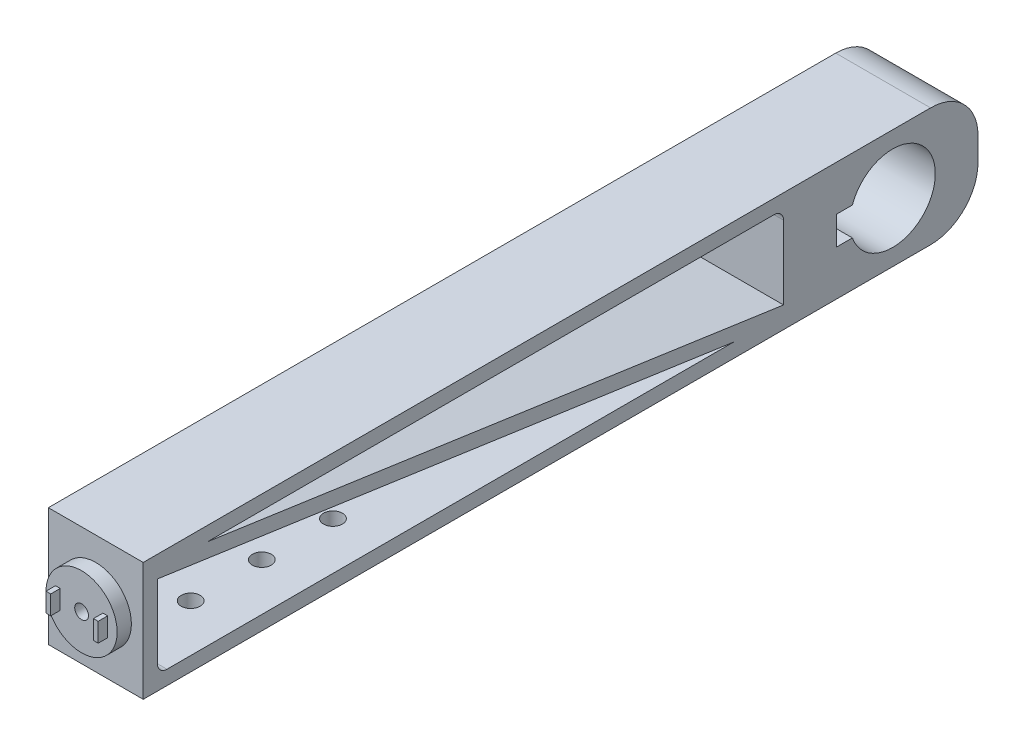
ISO-10303-21;
HEADER;
FILE_DESCRIPTION(('STEP AP214'),'2;1');
FILE_NAME('part.step','',(''),(''),'','','');
FILE_SCHEMA(('AUTOMOTIVE_DESIGN { 1 0 10303 214 1 1 1 1 }'));
ENDSEC;
DATA;
#1=APPLICATION_CONTEXT('core data for automotive mechanical design processes');
#2=APPLICATION_PROTOCOL_DEFINITION('international standard','automotive_design',2000,#1);
#3=PRODUCT_CONTEXT('',#1,'mechanical');
#4=PRODUCT('Part','Part','',(#3));
#5=PRODUCT_RELATED_PRODUCT_CATEGORY('part','',(#4));
#6=PRODUCT_DEFINITION_FORMATION('','',#4);
#7=PRODUCT_DEFINITION_CONTEXT('part definition',#1,'design');
#8=PRODUCT_DEFINITION('design','',#6,#7);
#9=PRODUCT_DEFINITION_SHAPE('','',#8);
#10=(LENGTH_UNIT() NAMED_UNIT(*) SI_UNIT(.MILLI.,.METRE.));
#11=(NAMED_UNIT(*) PLANE_ANGLE_UNIT() SI_UNIT($,.RADIAN.));
#12=(NAMED_UNIT(*) SI_UNIT($,.STERADIAN.) SOLID_ANGLE_UNIT());
#13=UNCERTAINTY_MEASURE_WITH_UNIT(LENGTH_MEASURE(1.E-05),#10,'distance_accuracy_value','');
#14=(GEOMETRIC_REPRESENTATION_CONTEXT(3) GLOBAL_UNCERTAINTY_ASSIGNED_CONTEXT((#13)) GLOBAL_UNIT_ASSIGNED_CONTEXT((#10,
#11,#12)) REPRESENTATION_CONTEXT('',''));
#15=CARTESIAN_POINT('',(0.,0.,0.));
#16=DIRECTION('',(0.,0.,1.));
#17=DIRECTION('',(1.,0.,0.));
#18=AXIS2_PLACEMENT_3D('',#15,#16,#17);
#19=CARTESIAN_POINT('',(10.,0.,91.));
#20=DIRECTION('',(0.,0.,1.));
#21=DIRECTION('',(1.,0.,0.));
#22=AXIS2_PLACEMENT_3D('',#19,#20,#21);
#23=PLANE('',#22);
#24=CARTESIAN_POINT('',(10.,0.,91.));
#25=DIRECTION('',(0.,0.,1.));
#26=DIRECTION('',(1.,0.,0.));
#27=AXIS2_PLACEMENT_3D('',#24,#25,#26);
#28=CIRCLE('',#27,1.45);
#29=CARTESIAN_POINT('',(11.45,0.,91.));
#30=VERTEX_POINT('',#29);
#31=EDGE_CURVE('E551',#30,#30,#28,.T.);
#32=ORIENTED_EDGE('',*,*,#31,.F.);
#33=EDGE_LOOP('',(#32));
#34=FACE_BOUND('',#33,.T.);
#35=CARTESIAN_POINT('',(10.,0.,91.));
#36=DIRECTION('',(0.,0.,1.));
#37=DIRECTION('',(1.,0.,0.));
#38=AXIS2_PLACEMENT_3D('',#35,#36,#37);
#39=CIRCLE('',#38,7.5);
#40=CARTESIAN_POINT('',(17.5,0.,91.));
#41=VERTEX_POINT('',#40);
#42=EDGE_CURVE('E287',#41,#41,#39,.T.);
#43=ORIENTED_EDGE('',*,*,#42,.T.);
#44=EDGE_LOOP('',(#43));
#45=FACE_BOUND('',#44,.T.);
#46=DIRECTION('',(1.,0.,0.));
#47=VECTOR('',#46,1.);
#48=CARTESIAN_POINT('',(15.5,-2.,91.));
#49=LINE('',#48,#47);
#50=CARTESIAN_POINT('',(14.5,-2.,91.));
#51=VERTEX_POINT('',#50);
#52=CARTESIAN_POINT('',(15.5,-2.,91.));
#53=VERTEX_POINT('',#52);
#54=EDGE_CURVE('E256',#51,#53,#49,.T.);
#55=ORIENTED_EDGE('',*,*,#54,.F.);
#56=DIRECTION('',(0.,-1.,0.));
#57=VECTOR('',#56,1.);
#58=CARTESIAN_POINT('',(14.5,-2.,91.));
#59=LINE('',#58,#57);
#60=CARTESIAN_POINT('',(14.5,2.,91.));
#61=VERTEX_POINT('',#60);
#62=EDGE_CURVE('E253',#61,#51,#59,.T.);
#63=ORIENTED_EDGE('',*,*,#62,.F.);
#64=DIRECTION('',(-1.,0.,0.));
#65=VECTOR('',#64,1.);
#66=CARTESIAN_POINT('',(15.5,2.,91.));
#67=LINE('',#66,#65);
#68=CARTESIAN_POINT('',(15.5,2.,91.));
#69=VERTEX_POINT('',#68);
#70=EDGE_CURVE('E266',#69,#61,#67,.T.);
#71=ORIENTED_EDGE('',*,*,#70,.F.);
#72=DIRECTION('',(0.,1.,0.));
#73=VECTOR('',#72,1.);
#74=CARTESIAN_POINT('',(15.5,-2.,91.));
#75=LINE('',#74,#73);
#76=EDGE_CURVE('E274',#53,#69,#75,.T.);
#77=ORIENTED_EDGE('',*,*,#76,.F.);
#78=EDGE_LOOP('',(#55,#63,#71,#77));
#79=FACE_BOUND('',#78,.T.);
#80=DIRECTION('',(1.,0.,0.));
#81=VECTOR('',#80,1.);
#82=CARTESIAN_POINT('',(4.5,-2.,91.));
#83=LINE('',#82,#81);
#84=CARTESIAN_POINT('',(4.5,-2.,91.));
#85=VERTEX_POINT('',#84);
#86=CARTESIAN_POINT('',(5.5,-2.,91.));
#87=VERTEX_POINT('',#86);
#88=EDGE_CURVE('E560',#85,#87,#83,.T.);
#89=ORIENTED_EDGE('',*,*,#88,.F.);
#90=DIRECTION('',(0.,-1.,0.));
#91=VECTOR('',#90,1.);
#92=CARTESIAN_POINT('',(4.5,-2.,91.));
#93=LINE('',#92,#91);
#94=CARTESIAN_POINT('',(4.5,2.,91.));
#95=VERTEX_POINT('',#94);
#96=EDGE_CURVE('E251',#95,#85,#93,.T.);
#97=ORIENTED_EDGE('',*,*,#96,.F.);
#98=DIRECTION('',(-1.,0.,0.));
#99=VECTOR('',#98,1.);
#100=CARTESIAN_POINT('',(4.5,2.,91.));
#101=LINE('',#100,#99);
#102=CARTESIAN_POINT('',(5.5,2.,91.));
#103=VERTEX_POINT('',#102);
#104=EDGE_CURVE('E247',#103,#95,#101,.T.);
#105=ORIENTED_EDGE('',*,*,#104,.F.);
#106=DIRECTION('',(0.,1.,0.));
#107=VECTOR('',#106,1.);
#108=CARTESIAN_POINT('',(5.5,-2.,91.));
#109=LINE('',#108,#107);
#110=EDGE_CURVE('E562',#87,#103,#109,.T.);
#111=ORIENTED_EDGE('',*,*,#110,.F.);
#112=EDGE_LOOP('',(#89,#97,#105,#111));
#113=FACE_BOUND('',#112,.T.);
#114=ADVANCED_FACE('F55',(#34,#45,#79,#113),#23,.T.);
#115=CARTESIAN_POINT('',(20.,0.,-88.));
#116=DIRECTION('',(0.,0.,-1.));
#117=DIRECTION('',(-1.,0.,0.));
#118=AXIS2_PLACEMENT_3D('',#115,#116,#117);
#119=PLANE('',#118);
#120=DIRECTION('',(0.,-1.,0.));
#121=VECTOR('',#120,1.);
#122=CARTESIAN_POINT('',(0.,0.,-88.));
#123=LINE('',#122,#121);
#124=CARTESIAN_POINT('',(0.,2.5,-88.));
#125=VERTEX_POINT('',#124);
#126=CARTESIAN_POINT('',(0.,-2.5,-88.));
#127=VERTEX_POINT('',#126);
#128=EDGE_CURVE('E366',#125,#127,#123,.T.);
#129=ORIENTED_EDGE('',*,*,#128,.F.);
#130=DIRECTION('',(-1.,0.,0.));
#131=VECTOR('',#130,1.);
#132=CARTESIAN_POINT('',(20.,2.5,-88.));
#133=LINE('',#132,#131);
#134=CARTESIAN_POINT('',(20.,2.5,-88.));
#135=VERTEX_POINT('',#134);
#136=EDGE_CURVE('E295',#135,#125,#133,.T.);
#137=ORIENTED_EDGE('',*,*,#136,.F.);
#138=DIRECTION('',(0.,-1.,0.));
#139=VECTOR('',#138,1.);
#140=CARTESIAN_POINT('',(20.,0.,-88.));
#141=LINE('',#140,#139);
#142=CARTESIAN_POINT('',(20.,-2.5,-88.));
#143=VERTEX_POINT('',#142);
#144=EDGE_CURVE('E323',#135,#143,#141,.T.);
#145=ORIENTED_EDGE('',*,*,#144,.T.);
#146=DIRECTION('',(-1.,0.,0.));
#147=VECTOR('',#146,1.);
#148=CARTESIAN_POINT('',(20.,-2.5,-88.));
#149=LINE('',#148,#147);
#150=EDGE_CURVE('E383',#143,#127,#149,.T.);
#151=ORIENTED_EDGE('',*,*,#150,.T.);
#152=EDGE_LOOP('',(#129,#137,#145,#151));
#153=FACE_BOUND('',#152,.T.);
#154=ADVANCED_FACE('F461',(#153),#119,.T.);
#155=CARTESIAN_POINT('',(20.,2.5,-78.));
#156=DIRECTION('',(-1.,0.,0.));
#157=DIRECTION('',(0.,0.,1.));
#158=AXIS2_PLACEMENT_3D('',#155,#156,#157);
#159=CYLINDRICAL_SURFACE('',#158,10.);
#160=CARTESIAN_POINT('',(0.,2.5,-78.));
#161=DIRECTION('',(1.,0.,0.));
#162=DIRECTION('',(0.,0.,-1.));
#163=AXIS2_PLACEMENT_3D('',#160,#161,#162);
#164=CIRCLE('',#163,10.);
#165=CARTESIAN_POINT('',(0.,12.5,-78.));
#166=VERTEX_POINT('',#165);
#167=EDGE_CURVE('E369',#125,#166,#164,.T.);
#168=ORIENTED_EDGE('',*,*,#167,.T.);
#169=DIRECTION('',(-1.,0.,0.));
#170=VECTOR('',#169,1.);
#171=CARTESIAN_POINT('',(20.,12.5,-78.));
#172=LINE('',#171,#170);
#173=CARTESIAN_POINT('',(20.,12.5,-78.));
#174=VERTEX_POINT('',#173);
#175=EDGE_CURVE('E394',#174,#166,#172,.T.);
#176=ORIENTED_EDGE('',*,*,#175,.F.);
#177=CARTESIAN_POINT('',(20.,2.5,-78.));
#178=DIRECTION('',(1.,0.,0.));
#179=DIRECTION('',(0.,0.,-1.));
#180=AXIS2_PLACEMENT_3D('',#177,#178,#179);
#181=CIRCLE('',#180,10.);
#182=EDGE_CURVE('E326',#135,#174,#181,.T.);
#183=ORIENTED_EDGE('',*,*,#182,.F.);
#184=ORIENTED_EDGE('',*,*,#136,.T.);
#185=EDGE_LOOP('',(#168,#176,#183,#184));
#186=FACE_BOUND('',#185,.T.);
#187=ADVANCED_FACE('F466',(#186),#159,.T.);
#188=CARTESIAN_POINT('',(20.,12.5,0.));
#189=DIRECTION('',(0.,1.,0.));
#190=DIRECTION('',(0.,0.,1.));
#191=AXIS2_PLACEMENT_3D('',#188,#189,#190);
#192=PLANE('',#191);
#193=DIRECTION('',(0.,0.,-1.));
#194=VECTOR('',#193,1.);
#195=CARTESIAN_POINT('',(0.,12.5,0.));
#196=LINE('',#195,#194);
#197=CARTESIAN_POINT('',(0.,12.5,88.));
#198=VERTEX_POINT('',#197);
#199=EDGE_CURVE('E372',#198,#166,#196,.T.);
#200=ORIENTED_EDGE('',*,*,#199,.F.);
#201=DIRECTION('',(-1.,0.,0.));
#202=VECTOR('',#201,1.);
#203=CARTESIAN_POINT('',(20.,12.5,88.));
#204=LINE('',#203,#202);
#205=CARTESIAN_POINT('',(20.,12.5,88.));
#206=VERTEX_POINT('',#205);
#207=EDGE_CURVE('E392',#206,#198,#204,.T.);
#208=ORIENTED_EDGE('',*,*,#207,.F.);
#209=DIRECTION('',(0.,0.,-1.));
#210=VECTOR('',#209,1.);
#211=CARTESIAN_POINT('',(20.,12.5,0.));
#212=LINE('',#211,#210);
#213=EDGE_CURVE('E328',#206,#174,#212,.T.);
#214=ORIENTED_EDGE('',*,*,#213,.T.);
#215=ORIENTED_EDGE('',*,*,#175,.T.);
#216=EDGE_LOOP('',(#200,#208,#214,#215));
#217=FACE_BOUND('',#216,.T.);
#218=ADVANCED_FACE('F495',(#217),#192,.T.);
#219=CARTESIAN_POINT('',(20.,0.,88.));
#220=DIRECTION('',(0.,0.,-1.));
#221=DIRECTION('',(-1.,0.,0.));
#222=AXIS2_PLACEMENT_3D('',#219,#220,#221);
#223=PLANE('',#222);
#224=CARTESIAN_POINT('',(10.,0.,88.));
#225=DIRECTION('',(0.,0.,1.));
#226=DIRECTION('',(1.,0.,0.));
#227=AXIS2_PLACEMENT_3D('',#224,#225,#226);
#228=CIRCLE('',#227,7.5);
#229=CARTESIAN_POINT('',(17.5,0.,88.));
#230=VERTEX_POINT('',#229);
#231=EDGE_CURVE('E291',#230,#230,#228,.T.);
#232=ORIENTED_EDGE('',*,*,#231,.F.);
#233=EDGE_LOOP('',(#232));
#234=FACE_BOUND('',#233,.T.);
#235=DIRECTION('',(0.,-1.,0.));
#236=VECTOR('',#235,1.);
#237=CARTESIAN_POINT('',(0.,0.,88.));
#238=LINE('',#237,#236);
#239=CARTESIAN_POINT('',(0.,-12.5,88.));
#240=VERTEX_POINT('',#239);
#241=EDGE_CURVE('E375',#198,#240,#238,.T.);
#242=ORIENTED_EDGE('',*,*,#241,.T.);
#243=DIRECTION('',(-1.,0.,0.));
#244=VECTOR('',#243,1.);
#245=CARTESIAN_POINT('',(20.,-12.5,88.));
#246=LINE('',#245,#244);
#247=CARTESIAN_POINT('',(20.,-12.5,88.));
#248=VERTEX_POINT('',#247);
#249=EDGE_CURVE('E389',#248,#240,#246,.T.);
#250=ORIENTED_EDGE('',*,*,#249,.F.);
#251=DIRECTION('',(0.,-1.,0.));
#252=VECTOR('',#251,1.);
#253=CARTESIAN_POINT('',(20.,0.,88.));
#254=LINE('',#253,#252);
#255=EDGE_CURVE('E331',#206,#248,#254,.T.);
#256=ORIENTED_EDGE('',*,*,#255,.F.);
#257=ORIENTED_EDGE('',*,*,#207,.T.);
#258=EDGE_LOOP('',(#242,#250,#256,#257));
#259=FACE_BOUND('',#258,.T.);
#260=ADVANCED_FACE('F491',(#234,#259),#223,.F.);
#261=CARTESIAN_POINT('',(20.,-12.5,0.));
#262=DIRECTION('',(0.,1.,0.));
#263=DIRECTION('',(0.,0.,1.));
#264=AXIS2_PLACEMENT_3D('',#261,#262,#263);
#265=PLANE('',#264);
#266=CARTESIAN_POINT('',(9.99999999999999,-12.5,38.));
#267=DIRECTION('',(0.,1.,0.));
#268=DIRECTION('',(0.,0.,1.));
#269=AXIS2_PLACEMENT_3D('',#266,#267,#268);
#270=CIRCLE('',#269,2.);
#271=CARTESIAN_POINT('',(9.99999999999999,-12.5,40.));
#272=VERTEX_POINT('',#271);
#273=EDGE_CURVE('E547',#272,#272,#270,.T.);
#274=ORIENTED_EDGE('',*,*,#273,.T.);
#275=EDGE_LOOP('',(#274));
#276=FACE_BOUND('',#275,.T.);
#277=CARTESIAN_POINT('',(9.99999999999999,-12.5,68.));
#278=DIRECTION('',(0.,1.,0.));
#279=DIRECTION('',(0.,0.,1.));
#280=AXIS2_PLACEMENT_3D('',#277,#278,#279);
#281=CIRCLE('',#280,2.);
#282=CARTESIAN_POINT('',(9.99999999999999,-12.5,70.));
#283=VERTEX_POINT('',#282);
#284=EDGE_CURVE('E540',#283,#283,#281,.T.);
#285=ORIENTED_EDGE('',*,*,#284,.T.);
#286=EDGE_LOOP('',(#285));
#287=FACE_BOUND('',#286,.T.);
#288=CARTESIAN_POINT('',(9.99999999999999,-12.5,53.));
#289=DIRECTION('',(0.,1.,0.));
#290=DIRECTION('',(0.,0.,1.));
#291=AXIS2_PLACEMENT_3D('',#288,#289,#290);
#292=CIRCLE('',#291,2.);
#293=CARTESIAN_POINT('',(9.99999999999999,-12.5,55.));
#294=VERTEX_POINT('',#293);
#295=EDGE_CURVE('E537',#294,#294,#292,.T.);
#296=ORIENTED_EDGE('',*,*,#295,.T.);
#297=EDGE_LOOP('',(#296));
#298=FACE_BOUND('',#297,.T.);
#299=DIRECTION('',(0.,0.,-1.));
#300=VECTOR('',#299,1.);
#301=CARTESIAN_POINT('',(0.,-12.5,0.));
#302=LINE('',#301,#300);
#303=CARTESIAN_POINT('',(0.,-12.5,-78.));
#304=VERTEX_POINT('',#303);
#305=EDGE_CURVE('E378',#240,#304,#302,.T.);
#306=ORIENTED_EDGE('',*,*,#305,.T.);
#307=DIRECTION('',(-1.,0.,0.));
#308=VECTOR('',#307,1.);
#309=CARTESIAN_POINT('',(20.,-12.5,-78.));
#310=LINE('',#309,#308);
#311=CARTESIAN_POINT('',(20.,-12.5,-78.));
#312=VERTEX_POINT('',#311);
#313=EDGE_CURVE('E385',#312,#304,#310,.T.);
#314=ORIENTED_EDGE('',*,*,#313,.F.);
#315=DIRECTION('',(0.,0.,-1.));
#316=VECTOR('',#315,1.);
#317=CARTESIAN_POINT('',(20.,-12.5,0.));
#318=LINE('',#317,#316);
#319=EDGE_CURVE('E334',#248,#312,#318,.T.);
#320=ORIENTED_EDGE('',*,*,#319,.F.);
#321=ORIENTED_EDGE('',*,*,#249,.T.);
#322=EDGE_LOOP('',(#306,#314,#320,#321));
#323=FACE_BOUND('',#322,.T.);
#324=ADVANCED_FACE('F487',(#276,#287,#298,#323),#265,.F.);
#325=CARTESIAN_POINT('',(20.,0.,-70.));
#326=DIRECTION('',(-1.,0.,0.));
#327=DIRECTION('',(0.,0.,1.));
#328=AXIS2_PLACEMENT_3D('',#325,#326,#327);
#329=CYLINDRICAL_SURFACE('',#328,9.);
#330=CARTESIAN_POINT('',(0.,0.,-70.));
#331=DIRECTION('',(1.,0.,0.));
#332=DIRECTION('',(0.,0.,-1.));
#333=AXIS2_PLACEMENT_3D('',#330,#331,#332);
#334=CIRCLE('',#333,9.);
#335=CARTESIAN_POINT('',(0.,-3.,-61.5147186257614));
#336=VERTEX_POINT('',#335);
#337=CARTESIAN_POINT('',(0.,3.,-61.5147186257614));
#338=VERTEX_POINT('',#337);
#339=EDGE_CURVE('E354',#336,#338,#334,.T.);
#340=ORIENTED_EDGE('',*,*,#339,.F.);
#341=DIRECTION('',(-1.,0.,0.));
#342=VECTOR('',#341,1.);
#343=CARTESIAN_POINT('',(20.,-3.,-61.5147186257614));
#344=LINE('',#343,#342);
#345=CARTESIAN_POINT('',(20.,-3.,-61.5147186257614));
#346=VERTEX_POINT('',#345);
#347=EDGE_CURVE('E386',#346,#336,#344,.T.);
#348=ORIENTED_EDGE('',*,*,#347,.F.);
#349=CARTESIAN_POINT('',(20.,0.,-70.));
#350=DIRECTION('',(1.,0.,0.));
#351=DIRECTION('',(0.,0.,-1.));
#352=AXIS2_PLACEMENT_3D('',#349,#350,#351);
#353=CIRCLE('',#352,9.);
#354=CARTESIAN_POINT('',(20.,3.,-61.5147186257614));
#355=VERTEX_POINT('',#354);
#356=EDGE_CURVE('E312',#346,#355,#353,.T.);
#357=ORIENTED_EDGE('',*,*,#356,.T.);
#358=DIRECTION('',(-1.,0.,0.));
#359=VECTOR('',#358,1.);
#360=CARTESIAN_POINT('',(20.,3.,-61.5147186257614));
#361=LINE('',#360,#359);
#362=EDGE_CURVE('E397',#355,#338,#361,.T.);
#363=ORIENTED_EDGE('',*,*,#362,.T.);
#364=EDGE_LOOP('',(#340,#348,#357,#363));
#365=FACE_BOUND('',#364,.T.);
#366=ADVANCED_FACE('F490',(#365),#329,.F.);
#367=CARTESIAN_POINT('',(20.,-3.,0.));
#368=DIRECTION('',(0.,-1.,0.));
#369=DIRECTION('',(0.,0.,-1.));
#370=AXIS2_PLACEMENT_3D('',#367,#368,#369);
#371=PLANE('',#370);
#372=DIRECTION('',(0.,0.,1.));
#373=VECTOR('',#372,1.);
#374=CARTESIAN_POINT('',(0.,-3.,0.));
#375=LINE('',#374,#373);
#376=CARTESIAN_POINT('',(0.,-3.,-58.2));
#377=VERTEX_POINT('',#376);
#378=EDGE_CURVE('E357',#336,#377,#375,.T.);
#379=ORIENTED_EDGE('',*,*,#378,.T.);
#380=DIRECTION('',(-1.,0.,0.));
#381=VECTOR('',#380,1.);
#382=CARTESIAN_POINT('',(20.,-3.,-58.2));
#383=LINE('',#382,#381);
#384=CARTESIAN_POINT('',(20.,-3.,-58.2));
#385=VERTEX_POINT('',#384);
#386=EDGE_CURVE('E402',#385,#377,#383,.T.);
#387=ORIENTED_EDGE('',*,*,#386,.F.);
#388=DIRECTION('',(0.,0.,1.));
#389=VECTOR('',#388,1.);
#390=CARTESIAN_POINT('',(20.,-3.,0.));
#391=LINE('',#390,#389);
#392=EDGE_CURVE('E315',#346,#385,#391,.T.);
#393=ORIENTED_EDGE('',*,*,#392,.F.);
#394=ORIENTED_EDGE('',*,*,#347,.T.);
#395=EDGE_LOOP('',(#379,#387,#393,#394));
#396=FACE_BOUND('',#395,.T.);
#397=ADVANCED_FACE('F507',(#396),#371,.F.);
#398=CARTESIAN_POINT('',(20.,0.,-58.2));
#399=DIRECTION('',(0.,0.,-1.));
#400=DIRECTION('',(-1.,0.,0.));
#401=AXIS2_PLACEMENT_3D('',#398,#399,#400);
#402=PLANE('',#401);
#403=DIRECTION('',(0.,-1.,0.));
#404=VECTOR('',#403,1.);
#405=CARTESIAN_POINT('',(0.,0.,-58.2));
#406=LINE('',#405,#404);
#407=CARTESIAN_POINT('',(0.,3.,-58.2));
#408=VERTEX_POINT('',#407);
#409=EDGE_CURVE('E360',#408,#377,#406,.T.);
#410=ORIENTED_EDGE('',*,*,#409,.F.);
#411=DIRECTION('',(-1.,0.,0.));
#412=VECTOR('',#411,1.);
#413=CARTESIAN_POINT('',(20.,3.,-58.2));
#414=LINE('',#413,#412);
#415=CARTESIAN_POINT('',(20.,3.,-58.2));
#416=VERTEX_POINT('',#415);
#417=EDGE_CURVE('E399',#416,#408,#414,.T.);
#418=ORIENTED_EDGE('',*,*,#417,.F.);
#419=DIRECTION('',(0.,-1.,0.));
#420=VECTOR('',#419,1.);
#421=CARTESIAN_POINT('',(20.,0.,-58.2));
#422=LINE('',#421,#420);
#423=EDGE_CURVE('E317',#416,#385,#422,.T.);
#424=ORIENTED_EDGE('',*,*,#423,.T.);
#425=ORIENTED_EDGE('',*,*,#386,.T.);
#426=EDGE_LOOP('',(#410,#418,#424,#425));
#427=FACE_BOUND('',#426,.T.);
#428=ADVANCED_FACE('F503',(#427),#402,.T.);
#429=CARTESIAN_POINT('',(20.,-1.19463806828892,0.171955479526435));
#430=DIRECTION('',(0.,0.989798967500017,-0.14247106350379));
#431=DIRECTION('',(0.,0.14247106350379,0.989798967500017));
#432=AXIS2_PLACEMENT_3D('',#429,#430,#431);
#433=PLANE('',#432);
#434=DIRECTION('',(0.,-0.14247106350379,-0.989798967500017));
#435=VECTOR('',#434,1.);
#436=CARTESIAN_POINT('',(0.,-1.19463806828892,0.171955479526435));
#437=LINE('',#436,#435);
#438=CARTESIAN_POINT('',(0.,9.5,74.4715462697441));
#439=VERTEX_POINT('',#438);
#440=CARTESIAN_POINT('',(0.,-7.98454075094802,-47.));
#441=VERTEX_POINT('',#440);
#442=EDGE_CURVE('E347',#439,#441,#437,.T.);
#443=ORIENTED_EDGE('',*,*,#442,.F.);
#444=DIRECTION('',(-1.,0.,0.));
#445=VECTOR('',#444,1.);
#446=CARTESIAN_POINT('',(20.,9.5,74.4715462697441));
#447=LINE('',#446,#445);
#448=CARTESIAN_POINT('',(20.,9.5,74.4715462697441));
#449=VERTEX_POINT('',#448);
#450=EDGE_CURVE('E400',#449,#439,#447,.T.);
#451=ORIENTED_EDGE('',*,*,#450,.F.);
#452=DIRECTION('',(0.,-0.14247106350379,-0.989798967500017));
#453=VECTOR('',#452,1.);
#454=CARTESIAN_POINT('',(20.,-1.19463806828892,0.171955479526435));
#455=LINE('',#454,#453);
#456=CARTESIAN_POINT('',(20.,-7.98454075094802,-47.));
#457=VERTEX_POINT('',#456);
#458=EDGE_CURVE('E305',#449,#457,#455,.T.);
#459=ORIENTED_EDGE('',*,*,#458,.T.);
#460=DIRECTION('',(-1.,0.,0.));
#461=VECTOR('',#460,1.);
#462=CARTESIAN_POINT('',(20.,-7.98454075094802,-47.));
#463=LINE('',#462,#461);
#464=EDGE_CURVE('E405',#457,#441,#463,.T.);
#465=ORIENTED_EDGE('',*,*,#464,.T.);
#466=EDGE_LOOP('',(#443,#451,#459,#465));
#467=FACE_BOUND('',#466,.T.);
#468=ADVANCED_FACE('F506',(#467),#433,.T.);
#469=CARTESIAN_POINT('',(20.,9.5,0.));
#470=DIRECTION('',(0.,1.,0.));
#471=DIRECTION('',(0.,0.,1.));
#472=AXIS2_PLACEMENT_3D('',#469,#470,#471);
#473=PLANE('',#472);
#474=DIRECTION('',(0.,0.,-1.));
#475=VECTOR('',#474,1.);
#476=CARTESIAN_POINT('',(0.,9.5,0.));
#477=LINE('',#476,#475);
#478=CARTESIAN_POINT('',(0.,9.5,-45.));
#479=VERTEX_POINT('',#478);
#480=EDGE_CURVE('E350',#439,#479,#477,.T.);
#481=ORIENTED_EDGE('',*,*,#480,.T.);
#482=DIRECTION('',(-1.,0.,0.));
#483=VECTOR('',#482,1.);
#484=CARTESIAN_POINT('',(20.,9.5,-45.));
#485=LINE('',#484,#483);
#486=CARTESIAN_POINT('',(20.,9.5,-45.));
#487=VERTEX_POINT('',#486);
#488=EDGE_CURVE('E70',#479,#487,#485,.F.);
#489=ORIENTED_EDGE('',*,*,#488,.T.);
#490=DIRECTION('',(0.,0.,-1.));
#491=VECTOR('',#490,1.);
#492=CARTESIAN_POINT('',(20.,9.5,0.));
#493=LINE('',#492,#491);
#494=EDGE_CURVE('E308',#449,#487,#493,.T.);
#495=ORIENTED_EDGE('',*,*,#494,.F.);
#496=ORIENTED_EDGE('',*,*,#450,.T.);
#497=EDGE_LOOP('',(#481,#489,#495,#496));
#498=FACE_BOUND('',#497,.T.);
#499=ADVANCED_FACE('F456',(#498),#473,.F.);
#500=CARTESIAN_POINT('',(20.,0.,85.));
#501=DIRECTION('',(0.,0.,-1.));
#502=DIRECTION('',(-1.,0.,0.));
#503=AXIS2_PLACEMENT_3D('',#500,#501,#502);
#504=PLANE('',#503);
#505=CARTESIAN_POINT('',(10.,0.,85.));
#506=DIRECTION('',(0.,0.,-1.));
#507=DIRECTION('',(-1.,0.,0.));
#508=AXIS2_PLACEMENT_3D('',#505,#506,#507);
#509=CIRCLE('',#508,1.45);
#510=CARTESIAN_POINT('',(8.55,0.,85.));
#511=VERTEX_POINT('',#510);
#512=EDGE_CURVE('E550',#511,#511,#509,.F.);
#513=ORIENTED_EDGE('',*,*,#512,.T.);
#514=EDGE_LOOP('',(#513));
#515=FACE_BOUND('',#514,.T.);
#516=DIRECTION('',(0.,-1.,0.));
#517=VECTOR('',#516,1.);
#518=CARTESIAN_POINT('',(20.,0.,85.));
#519=LINE('',#518,#517);
#520=CARTESIAN_POINT('',(20.,7.98454075094802,85.));
#521=VERTEX_POINT('',#520);
#522=CARTESIAN_POINT('',(20.,-7.5,85.));
#523=VERTEX_POINT('',#522);
#524=EDGE_CURVE('E296',#521,#523,#519,.T.);
#525=ORIENTED_EDGE('',*,*,#524,.T.);
#526=DIRECTION('',(-1.,0.,0.));
#527=VECTOR('',#526,1.);
#528=CARTESIAN_POINT('',(0.,-7.5,85.));
#529=LINE('',#528,#527);
#530=CARTESIAN_POINT('',(0.,-7.5,85.));
#531=VERTEX_POINT('',#530);
#532=EDGE_CURVE('E294',#523,#531,#529,.T.);
#533=ORIENTED_EDGE('',*,*,#532,.T.);
#534=DIRECTION('',(0.,-1.,0.));
#535=VECTOR('',#534,1.);
#536=CARTESIAN_POINT('',(0.,0.,85.));
#537=LINE('',#536,#535);
#538=CARTESIAN_POINT('',(0.,7.98454075094802,85.));
#539=VERTEX_POINT('',#538);
#540=EDGE_CURVE('E290',#539,#531,#537,.T.);
#541=ORIENTED_EDGE('',*,*,#540,.F.);
#542=DIRECTION('',(-1.,0.,0.));
#543=VECTOR('',#542,1.);
#544=CARTESIAN_POINT('',(20.,7.98454075094802,85.));
#545=LINE('',#544,#543);
#546=EDGE_CURVE('E408',#521,#539,#545,.T.);
#547=ORIENTED_EDGE('',*,*,#546,.F.);
#548=EDGE_LOOP('',(#525,#533,#541,#547));
#549=FACE_BOUND('',#548,.T.);
#550=ADVANCED_FACE('F434',(#515,#549),#504,.T.);
#551=CARTESIAN_POINT('',(20.,-4.16403497078897,0.599368670037806));
#552=DIRECTION('',(0.,0.989798967500017,-0.14247106350379));
#553=DIRECTION('',(0.,0.14247106350379,0.989798967500017));
#554=AXIS2_PLACEMENT_3D('',#551,#552,#553);
#555=PLANE('',#554);
#556=DIRECTION('',(0.,-0.14247106350379,-0.989798967500017));
#557=VECTOR('',#556,1.);
#558=CARTESIAN_POINT('',(0.,-4.16403497078897,0.599368670037806));
#559=LINE('',#558,#557);
#560=CARTESIAN_POINT('',(0.,-9.5,-36.4715462697441));
#561=VERTEX_POINT('',#560);
#562=EDGE_CURVE('E342',#539,#561,#559,.T.);
#563=ORIENTED_EDGE('',*,*,#562,.T.);
#564=DIRECTION('',(-1.,0.,0.));
#565=VECTOR('',#564,1.);
#566=CARTESIAN_POINT('',(20.,-9.5,-36.4715462697441));
#567=LINE('',#566,#565);
#568=CARTESIAN_POINT('',(20.,-9.5,-36.4715462697441));
#569=VERTEX_POINT('',#568);
#570=EDGE_CURVE('E339',#569,#561,#567,.T.);
#571=ORIENTED_EDGE('',*,*,#570,.F.);
#572=DIRECTION('',(0.,-0.14247106350379,-0.989798967500017));
#573=VECTOR('',#572,1.);
#574=CARTESIAN_POINT('',(20.,-4.16403497078897,0.599368670037806));
#575=LINE('',#574,#573);
#576=EDGE_CURVE('E299',#521,#569,#575,.T.);
#577=ORIENTED_EDGE('',*,*,#576,.F.);
#578=ORIENTED_EDGE('',*,*,#546,.T.);
#579=EDGE_LOOP('',(#563,#571,#577,#578));
#580=FACE_BOUND('',#579,.T.);
#581=ADVANCED_FACE('F446',(#580),#555,.F.);
#582=CARTESIAN_POINT('',(20.,3.,0.));
#583=DIRECTION('',(0.,-1.,0.));
#584=DIRECTION('',(0.,0.,-1.));
#585=AXIS2_PLACEMENT_3D('',#582,#583,#584);
#586=PLANE('',#585);
#587=DIRECTION('',(0.,0.,1.));
#588=VECTOR('',#587,1.);
#589=CARTESIAN_POINT('',(0.,3.,0.));
#590=LINE('',#589,#588);
#591=EDGE_CURVE('E363',#338,#408,#590,.T.);
#592=ORIENTED_EDGE('',*,*,#591,.F.);
#593=ORIENTED_EDGE('',*,*,#362,.F.);
#594=DIRECTION('',(0.,0.,1.));
#595=VECTOR('',#594,1.);
#596=CARTESIAN_POINT('',(20.,3.,0.));
#597=LINE('',#596,#595);
#598=EDGE_CURVE('E320',#355,#416,#597,.T.);
#599=ORIENTED_EDGE('',*,*,#598,.T.);
#600=ORIENTED_EDGE('',*,*,#417,.T.);
#601=EDGE_LOOP('',(#592,#593,#599,#600));
#602=FACE_BOUND('',#601,.T.);
#603=ADVANCED_FACE('F448',(#602),#586,.T.);
#604=CARTESIAN_POINT('',(20.,0.,-47.));
#605=DIRECTION('',(0.,0.,-1.));
#606=DIRECTION('',(-1.,0.,0.));
#607=AXIS2_PLACEMENT_3D('',#604,#605,#606);
#608=PLANE('',#607);
#609=DIRECTION('',(0.,-1.,0.));
#610=VECTOR('',#609,1.);
#611=CARTESIAN_POINT('',(20.,0.,-47.));
#612=LINE('',#611,#610);
#613=CARTESIAN_POINT('',(20.,7.5,-47.));
#614=VERTEX_POINT('',#613);
#615=EDGE_CURVE('E310',#614,#457,#612,.T.);
#616=ORIENTED_EDGE('',*,*,#615,.F.);
#617=DIRECTION('',(-1.,0.,0.));
#618=VECTOR('',#617,1.);
#619=CARTESIAN_POINT('',(0.,7.5,-47.));
#620=LINE('',#619,#618);
#621=CARTESIAN_POINT('',(0.,7.5,-47.));
#622=VERTEX_POINT('',#621);
#623=EDGE_CURVE('E417',#614,#622,#620,.T.);
#624=ORIENTED_EDGE('',*,*,#623,.T.);
#625=DIRECTION('',(0.,-1.,0.));
#626=VECTOR('',#625,1.);
#627=CARTESIAN_POINT('',(0.,0.,-47.));
#628=LINE('',#627,#626);
#629=EDGE_CURVE('E352',#622,#441,#628,.T.);
#630=ORIENTED_EDGE('',*,*,#629,.T.);
#631=ORIENTED_EDGE('',*,*,#464,.F.);
#632=EDGE_LOOP('',(#616,#624,#630,#631));
#633=FACE_BOUND('',#632,.T.);
#634=ADVANCED_FACE('F453',(#633),#608,.F.);
#635=CARTESIAN_POINT('',(20.,-9.5,0.));
#636=DIRECTION('',(0.,1.,0.));
#637=DIRECTION('',(0.,0.,1.));
#638=AXIS2_PLACEMENT_3D('',#635,#636,#637);
#639=PLANE('',#638);
#640=CARTESIAN_POINT('',(9.99999999999999,-9.5,38.));
#641=DIRECTION('',(0.,1.,0.));
#642=DIRECTION('',(0.,0.,1.));
#643=AXIS2_PLACEMENT_3D('',#640,#641,#642);
#644=CIRCLE('',#643,2.);
#645=CARTESIAN_POINT('',(9.99999999999999,-9.5,40.));
#646=VERTEX_POINT('',#645);
#647=EDGE_CURVE('E528',#646,#646,#644,.T.);
#648=ORIENTED_EDGE('',*,*,#647,.F.);
#649=EDGE_LOOP('',(#648));
#650=FACE_BOUND('',#649,.T.);
#651=CARTESIAN_POINT('',(9.99999999999999,-9.5,68.));
#652=DIRECTION('',(0.,1.,0.));
#653=DIRECTION('',(0.,0.,1.));
#654=AXIS2_PLACEMENT_3D('',#651,#652,#653);
#655=CIRCLE('',#654,2.);
#656=CARTESIAN_POINT('',(9.99999999999999,-9.5,70.));
#657=VERTEX_POINT('',#656);
#658=EDGE_CURVE('E532',#657,#657,#655,.T.);
#659=ORIENTED_EDGE('',*,*,#658,.F.);
#660=EDGE_LOOP('',(#659));
#661=FACE_BOUND('',#660,.T.);
#662=CARTESIAN_POINT('',(9.99999999999999,-9.5,53.));
#663=DIRECTION('',(0.,1.,0.));
#664=DIRECTION('',(0.,0.,1.));
#665=AXIS2_PLACEMENT_3D('',#662,#663,#664);
#666=CIRCLE('',#665,2.);
#667=CARTESIAN_POINT('',(9.99999999999999,-9.5,55.));
#668=VERTEX_POINT('',#667);
#669=EDGE_CURVE('E535',#668,#668,#666,.T.);
#670=ORIENTED_EDGE('',*,*,#669,.F.);
#671=EDGE_LOOP('',(#670));
#672=FACE_BOUND('',#671,.T.);
#673=DIRECTION('',(0.,0.,-1.));
#674=VECTOR('',#673,1.);
#675=CARTESIAN_POINT('',(0.,-9.5,0.));
#676=LINE('',#675,#674);
#677=CARTESIAN_POINT('',(0.,-9.5,83.));
#678=VERTEX_POINT('',#677);
#679=EDGE_CURVE('E345',#678,#561,#676,.T.);
#680=ORIENTED_EDGE('',*,*,#679,.F.);
#681=DIRECTION('',(-1.,0.,0.));
#682=VECTOR('',#681,1.);
#683=CARTESIAN_POINT('',(20.,-9.5,83.));
#684=LINE('',#683,#682);
#685=CARTESIAN_POINT('',(20.,-9.5,83.));
#686=VERTEX_POINT('',#685);
#687=EDGE_CURVE('E415',#678,#686,#684,.F.);
#688=ORIENTED_EDGE('',*,*,#687,.T.);
#689=DIRECTION('',(0.,0.,-1.));
#690=VECTOR('',#689,1.);
#691=CARTESIAN_POINT('',(20.,-9.5,0.));
#692=LINE('',#691,#690);
#693=EDGE_CURVE('E303',#686,#569,#692,.T.);
#694=ORIENTED_EDGE('',*,*,#693,.T.);
#695=ORIENTED_EDGE('',*,*,#570,.T.);
#696=EDGE_LOOP('',(#680,#688,#694,#695));
#697=FACE_BOUND('',#696,.T.);
#698=ADVANCED_FACE('F443',(#650,#661,#672,#697),#639,.T.);
#699=CARTESIAN_POINT('',(20.,-2.5,-78.));
#700=DIRECTION('',(-1.,0.,0.));
#701=DIRECTION('',(0.,0.,1.));
#702=AXIS2_PLACEMENT_3D('',#699,#700,#701);
#703=CYLINDRICAL_SURFACE('',#702,10.);
#704=CARTESIAN_POINT('',(0.,-2.5,-78.));
#705=DIRECTION('',(1.,0.,0.));
#706=DIRECTION('',(0.,0.,-1.));
#707=AXIS2_PLACEMENT_3D('',#704,#705,#706);
#708=CIRCLE('',#707,10.);
#709=EDGE_CURVE('E300',#304,#127,#708,.T.);
#710=ORIENTED_EDGE('',*,*,#709,.T.);
#711=ORIENTED_EDGE('',*,*,#150,.F.);
#712=CARTESIAN_POINT('',(20.,-2.5,-78.));
#713=DIRECTION('',(1.,0.,0.));
#714=DIRECTION('',(0.,0.,-1.));
#715=AXIS2_PLACEMENT_3D('',#712,#713,#714);
#716=CIRCLE('',#715,10.);
#717=EDGE_CURVE('E337',#312,#143,#716,.T.);
#718=ORIENTED_EDGE('',*,*,#717,.F.);
#719=ORIENTED_EDGE('',*,*,#313,.T.);
#720=EDGE_LOOP('',(#710,#711,#718,#719));
#721=FACE_BOUND('',#720,.T.);
#722=ADVANCED_FACE('F481',(#721),#703,.T.);
#723=CARTESIAN_POINT('',(20.,0.,0.));
#724=DIRECTION('',(1.,0.,0.));
#725=DIRECTION('',(0.,0.,-1.));
#726=AXIS2_PLACEMENT_3D('',#723,#724,#725);
#727=PLANE('',#726);
#728=ORIENTED_EDGE('',*,*,#524,.F.);
#729=ORIENTED_EDGE('',*,*,#576,.T.);
#730=ORIENTED_EDGE('',*,*,#693,.F.);
#731=CARTESIAN_POINT('',(20.,-7.5,83.));
#732=DIRECTION('',(1.,0.,0.));
#733=DIRECTION('',(0.,0.,-1.));
#734=AXIS2_PLACEMENT_3D('',#731,#732,#733);
#735=CIRCLE('',#734,2.);
#736=EDGE_CURVE('E423',#686,#523,#735,.F.);
#737=ORIENTED_EDGE('',*,*,#736,.T.);
#738=EDGE_LOOP('',(#728,#729,#730,#737));
#739=FACE_BOUND('',#738,.T.);
#740=ORIENTED_EDGE('',*,*,#458,.F.);
#741=ORIENTED_EDGE('',*,*,#494,.T.);
#742=CARTESIAN_POINT('',(20.,7.5,-45.));
#743=DIRECTION('',(1.,0.,0.));
#744=DIRECTION('',(0.,0.,-1.));
#745=AXIS2_PLACEMENT_3D('',#742,#743,#744);
#746=CIRCLE('',#745,2.);
#747=EDGE_CURVE('E13',#487,#614,#746,.F.);
#748=ORIENTED_EDGE('',*,*,#747,.T.);
#749=ORIENTED_EDGE('',*,*,#615,.T.);
#750=EDGE_LOOP('',(#740,#741,#748,#749));
#751=FACE_BOUND('',#750,.T.);
#752=ORIENTED_EDGE('',*,*,#356,.F.);
#753=ORIENTED_EDGE('',*,*,#392,.T.);
#754=ORIENTED_EDGE('',*,*,#423,.F.);
#755=ORIENTED_EDGE('',*,*,#598,.F.);
#756=EDGE_LOOP('',(#752,#753,#754,#755));
#757=FACE_BOUND('',#756,.T.);
#758=ORIENTED_EDGE('',*,*,#144,.F.);
#759=ORIENTED_EDGE('',*,*,#182,.T.);
#760=ORIENTED_EDGE('',*,*,#213,.F.);
#761=ORIENTED_EDGE('',*,*,#255,.T.);
#762=ORIENTED_EDGE('',*,*,#319,.T.);
#763=ORIENTED_EDGE('',*,*,#717,.T.);
#764=EDGE_LOOP('',(#758,#759,#760,#761,#762,#763));
#765=FACE_BOUND('',#764,.T.);
#766=ADVANCED_FACE('F428',(#739,#751,#757,#765),#727,.T.);
#767=CARTESIAN_POINT('',(0.,0.,0.));
#768=DIRECTION('',(1.,0.,0.));
#769=DIRECTION('',(0.,0.,-1.));
#770=AXIS2_PLACEMENT_3D('',#767,#768,#769);
#771=PLANE('',#770);
#772=ORIENTED_EDGE('',*,*,#540,.T.);
#773=CARTESIAN_POINT('',(0.,-7.5,83.));
#774=DIRECTION('',(1.,0.,0.));
#775=DIRECTION('',(0.,0.,-1.));
#776=AXIS2_PLACEMENT_3D('',#773,#774,#775);
#777=CIRCLE('',#776,2.);
#778=EDGE_CURVE('E421',#531,#678,#777,.T.);
#779=ORIENTED_EDGE('',*,*,#778,.T.);
#780=ORIENTED_EDGE('',*,*,#679,.T.);
#781=ORIENTED_EDGE('',*,*,#562,.F.);
#782=EDGE_LOOP('',(#772,#779,#780,#781));
#783=FACE_BOUND('',#782,.T.);
#784=ORIENTED_EDGE('',*,*,#442,.T.);
#785=ORIENTED_EDGE('',*,*,#629,.F.);
#786=CARTESIAN_POINT('',(0.,7.5,-45.));
#787=DIRECTION('',(1.,0.,0.));
#788=DIRECTION('',(0.,0.,-1.));
#789=AXIS2_PLACEMENT_3D('',#786,#787,#788);
#790=CIRCLE('',#789,2.);
#791=EDGE_CURVE('E63',#622,#479,#790,.T.);
#792=ORIENTED_EDGE('',*,*,#791,.T.);
#793=ORIENTED_EDGE('',*,*,#480,.F.);
#794=EDGE_LOOP('',(#784,#785,#792,#793));
#795=FACE_BOUND('',#794,.T.);
#796=ORIENTED_EDGE('',*,*,#339,.T.);
#797=ORIENTED_EDGE('',*,*,#591,.T.);
#798=ORIENTED_EDGE('',*,*,#409,.T.);
#799=ORIENTED_EDGE('',*,*,#378,.F.);
#800=EDGE_LOOP('',(#796,#797,#798,#799));
#801=FACE_BOUND('',#800,.T.);
#802=ORIENTED_EDGE('',*,*,#128,.T.);
#803=ORIENTED_EDGE('',*,*,#709,.F.);
#804=ORIENTED_EDGE('',*,*,#305,.F.);
#805=ORIENTED_EDGE('',*,*,#241,.F.);
#806=ORIENTED_EDGE('',*,*,#199,.T.);
#807=ORIENTED_EDGE('',*,*,#167,.F.);
#808=EDGE_LOOP('',(#802,#803,#804,#805,#806,#807));
#809=FACE_BOUND('',#808,.T.);
#810=ADVANCED_FACE('F440',(#783,#795,#801,#809),#771,.F.);
#811=CARTESIAN_POINT('',(10.,0.,91.));
#812=DIRECTION('',(0.,0.,-1.));
#813=DIRECTION('',(-1.,0.,0.));
#814=AXIS2_PLACEMENT_3D('',#811,#812,#813);
#815=CYLINDRICAL_SURFACE('',#814,7.5);
#816=ORIENTED_EDGE('',*,*,#42,.F.);
#817=EDGE_LOOP('',(#816));
#818=FACE_BOUND('',#817,.T.);
#819=ORIENTED_EDGE('',*,*,#231,.T.);
#820=EDGE_LOOP('',(#819));
#821=FACE_BOUND('',#820,.T.);
#822=ADVANCED_FACE('F475',(#818,#821),#815,.T.);
#823=CARTESIAN_POINT('',(14.5,-2.,93.));
#824=DIRECTION('',(1.,0.,0.));
#825=DIRECTION('',(0.,0.,-1.));
#826=AXIS2_PLACEMENT_3D('',#823,#824,#825);
#827=PLANE('',#826);
#828=ORIENTED_EDGE('',*,*,#62,.T.);
#829=DIRECTION('',(0.,0.,-1.));
#830=VECTOR('',#829,1.);
#831=CARTESIAN_POINT('',(14.5,-2.,93.));
#832=LINE('',#831,#830);
#833=CARTESIAN_POINT('',(14.5,-2.,93.));
#834=VERTEX_POINT('',#833);
#835=EDGE_CURVE('E285',#834,#51,#832,.T.);
#836=ORIENTED_EDGE('',*,*,#835,.F.);
#837=DIRECTION('',(0.,-1.,0.));
#838=VECTOR('',#837,1.);
#839=CARTESIAN_POINT('',(14.5,-2.,93.));
#840=LINE('',#839,#838);
#841=CARTESIAN_POINT('',(14.5,2.,93.));
#842=VERTEX_POINT('',#841);
#843=EDGE_CURVE('E262',#842,#834,#840,.T.);
#844=ORIENTED_EDGE('',*,*,#843,.F.);
#845=DIRECTION('',(0.,0.,-1.));
#846=VECTOR('',#845,1.);
#847=CARTESIAN_POINT('',(14.5,2.,93.));
#848=LINE('',#847,#846);
#849=EDGE_CURVE('E271',#842,#61,#848,.T.);
#850=ORIENTED_EDGE('',*,*,#849,.T.);
#851=EDGE_LOOP('',(#828,#836,#844,#850));
#852=FACE_BOUND('',#851,.T.);
#853=ADVANCED_FACE('F473',(#852),#827,.F.);
#854=CARTESIAN_POINT('',(15.5,-2.,93.));
#855=DIRECTION('',(0.,1.,0.));
#856=DIRECTION('',(-1.,0.,0.));
#857=AXIS2_PLACEMENT_3D('',#854,#855,#856);
#858=PLANE('',#857);
#859=ORIENTED_EDGE('',*,*,#54,.T.);
#860=DIRECTION('',(0.,0.,-1.));
#861=VECTOR('',#860,1.);
#862=CARTESIAN_POINT('',(15.5,-2.,93.));
#863=LINE('',#862,#861);
#864=CARTESIAN_POINT('',(15.5,-2.,93.));
#865=VERTEX_POINT('',#864);
#866=EDGE_CURVE('E282',#865,#53,#863,.T.);
#867=ORIENTED_EDGE('',*,*,#866,.F.);
#868=DIRECTION('',(1.,0.,0.));
#869=VECTOR('',#868,1.);
#870=CARTESIAN_POINT('',(15.5,-2.,93.));
#871=LINE('',#870,#869);
#872=EDGE_CURVE('E265',#834,#865,#871,.T.);
#873=ORIENTED_EDGE('',*,*,#872,.F.);
#874=ORIENTED_EDGE('',*,*,#835,.T.);
#875=EDGE_LOOP('',(#859,#867,#873,#874));
#876=FACE_BOUND('',#875,.T.);
#877=ADVANCED_FACE('F595',(#876),#858,.F.);
#878=CARTESIAN_POINT('',(15.5,-2.,93.));
#879=DIRECTION('',(-1.,0.,0.));
#880=DIRECTION('',(0.,0.,1.));
#881=AXIS2_PLACEMENT_3D('',#878,#879,#880);
#882=PLANE('',#881);
#883=ORIENTED_EDGE('',*,*,#76,.T.);
#884=DIRECTION('',(0.,0.,-1.));
#885=VECTOR('',#884,1.);
#886=CARTESIAN_POINT('',(15.5,2.,93.));
#887=LINE('',#886,#885);
#888=CARTESIAN_POINT('',(15.5,2.,93.));
#889=VERTEX_POINT('',#888);
#890=EDGE_CURVE('E280',#889,#69,#887,.T.);
#891=ORIENTED_EDGE('',*,*,#890,.F.);
#892=DIRECTION('',(0.,1.,0.));
#893=VECTOR('',#892,1.);
#894=CARTESIAN_POINT('',(15.5,-2.,93.));
#895=LINE('',#894,#893);
#896=EDGE_CURVE('E268',#865,#889,#895,.T.);
#897=ORIENTED_EDGE('',*,*,#896,.F.);
#898=ORIENTED_EDGE('',*,*,#866,.T.);
#899=EDGE_LOOP('',(#883,#891,#897,#898));
#900=FACE_BOUND('',#899,.T.);
#901=ADVANCED_FACE('F592',(#900),#882,.F.);
#902=CARTESIAN_POINT('',(15.5,2.,93.));
#903=DIRECTION('',(0.,-1.,0.));
#904=DIRECTION('',(0.,0.,-1.));
#905=AXIS2_PLACEMENT_3D('',#902,#903,#904);
#906=PLANE('',#905);
#907=ORIENTED_EDGE('',*,*,#70,.T.);
#908=ORIENTED_EDGE('',*,*,#849,.F.);
#909=DIRECTION('',(-1.,0.,0.));
#910=VECTOR('',#909,1.);
#911=CARTESIAN_POINT('',(15.5,2.,93.));
#912=LINE('',#911,#910);
#913=EDGE_CURVE('E270',#889,#842,#912,.T.);
#914=ORIENTED_EDGE('',*,*,#913,.F.);
#915=ORIENTED_EDGE('',*,*,#890,.T.);
#916=EDGE_LOOP('',(#907,#908,#914,#915));
#917=FACE_BOUND('',#916,.T.);
#918=ADVANCED_FACE('F588',(#917),#906,.F.);
#919=CARTESIAN_POINT('',(0.,0.,93.));
#920=DIRECTION('',(0.,0.,1.));
#921=DIRECTION('',(1.,0.,0.));
#922=AXIS2_PLACEMENT_3D('',#919,#920,#921);
#923=PLANE('',#922);
#924=ORIENTED_EDGE('',*,*,#843,.T.);
#925=ORIENTED_EDGE('',*,*,#872,.T.);
#926=ORIENTED_EDGE('',*,*,#896,.T.);
#927=ORIENTED_EDGE('',*,*,#913,.T.);
#928=EDGE_LOOP('',(#924,#925,#926,#927));
#929=FACE_BOUND('',#928,.T.);
#930=ADVANCED_FACE('F585',(#929),#923,.T.);
#931=CARTESIAN_POINT('',(4.5,-2.,93.));
#932=DIRECTION('',(1.,0.,0.));
#933=DIRECTION('',(0.,0.,-1.));
#934=AXIS2_PLACEMENT_3D('',#931,#932,#933);
#935=PLANE('',#934);
#936=ORIENTED_EDGE('',*,*,#96,.T.);
#937=DIRECTION('',(0.,0.,-1.));
#938=VECTOR('',#937,1.);
#939=CARTESIAN_POINT('',(4.5,-2.,93.));
#940=LINE('',#939,#938);
#941=CARTESIAN_POINT('',(4.5,-2.,93.));
#942=VERTEX_POINT('',#941);
#943=EDGE_CURVE('E231',#942,#85,#940,.T.);
#944=ORIENTED_EDGE('',*,*,#943,.F.);
#945=DIRECTION('',(0.,-1.,0.));
#946=VECTOR('',#945,1.);
#947=CARTESIAN_POINT('',(4.5,-2.,93.));
#948=LINE('',#947,#946);
#949=CARTESIAN_POINT('',(4.5,2.,93.));
#950=VERTEX_POINT('',#949);
#951=EDGE_CURVE('E238',#950,#942,#948,.T.);
#952=ORIENTED_EDGE('',*,*,#951,.F.);
#953=DIRECTION('',(0.,0.,-1.));
#954=VECTOR('',#953,1.);
#955=CARTESIAN_POINT('',(4.5,2.,93.));
#956=LINE('',#955,#954);
#957=EDGE_CURVE('E558',#950,#95,#956,.T.);
#958=ORIENTED_EDGE('',*,*,#957,.T.);
#959=EDGE_LOOP('',(#936,#944,#952,#958));
#960=FACE_BOUND('',#959,.T.);
#961=ADVANCED_FACE('F249',(#960),#935,.F.);
#962=CARTESIAN_POINT('',(4.5,-2.,93.));
#963=DIRECTION('',(0.,1.,0.));
#964=DIRECTION('',(-1.,0.,0.));
#965=AXIS2_PLACEMENT_3D('',#962,#963,#964);
#966=PLANE('',#965);
#967=ORIENTED_EDGE('',*,*,#88,.T.);
#968=DIRECTION('',(0.,0.,-1.));
#969=VECTOR('',#968,1.);
#970=CARTESIAN_POINT('',(5.5,-2.,93.));
#971=LINE('',#970,#969);
#972=CARTESIAN_POINT('',(5.5,-2.,93.));
#973=VERTEX_POINT('',#972);
#974=EDGE_CURVE('E234',#973,#87,#971,.T.);
#975=ORIENTED_EDGE('',*,*,#974,.F.);
#976=DIRECTION('',(1.,0.,0.));
#977=VECTOR('',#976,1.);
#978=CARTESIAN_POINT('',(4.5,-2.,93.));
#979=LINE('',#978,#977);
#980=EDGE_CURVE('E227',#942,#973,#979,.T.);
#981=ORIENTED_EDGE('',*,*,#980,.F.);
#982=ORIENTED_EDGE('',*,*,#943,.T.);
#983=EDGE_LOOP('',(#967,#975,#981,#982));
#984=FACE_BOUND('',#983,.T.);
#985=ADVANCED_FACE('F229',(#984),#966,.F.);
#986=CARTESIAN_POINT('',(5.5,-2.,93.));
#987=DIRECTION('',(-1.,0.,0.));
#988=DIRECTION('',(0.,0.,1.));
#989=AXIS2_PLACEMENT_3D('',#986,#987,#988);
#990=PLANE('',#989);
#991=ORIENTED_EDGE('',*,*,#110,.T.);
#992=DIRECTION('',(0.,0.,-1.));
#993=VECTOR('',#992,1.);
#994=CARTESIAN_POINT('',(5.5,2.,93.));
#995=LINE('',#994,#993);
#996=CARTESIAN_POINT('',(5.5,2.,93.));
#997=VERTEX_POINT('',#996);
#998=EDGE_CURVE('E258',#997,#103,#995,.T.);
#999=ORIENTED_EDGE('',*,*,#998,.F.);
#1000=DIRECTION('',(0.,1.,0.));
#1001=VECTOR('',#1000,1.);
#1002=CARTESIAN_POINT('',(5.5,-2.,93.));
#1003=LINE('',#1002,#1001);
#1004=EDGE_CURVE('E237',#973,#997,#1003,.T.);
#1005=ORIENTED_EDGE('',*,*,#1004,.F.);
#1006=ORIENTED_EDGE('',*,*,#974,.T.);
#1007=EDGE_LOOP('',(#991,#999,#1005,#1006));
#1008=FACE_BOUND('',#1007,.T.);
#1009=ADVANCED_FACE('F572',(#1008),#990,.F.);
#1010=CARTESIAN_POINT('',(4.5,2.,93.));
#1011=DIRECTION('',(0.,-1.,0.));
#1012=DIRECTION('',(0.,0.,-1.));
#1013=AXIS2_PLACEMENT_3D('',#1010,#1011,#1012);
#1014=PLANE('',#1013);
#1015=ORIENTED_EDGE('',*,*,#104,.T.);
#1016=ORIENTED_EDGE('',*,*,#957,.F.);
#1017=DIRECTION('',(-1.,0.,0.));
#1018=VECTOR('',#1017,1.);
#1019=CARTESIAN_POINT('',(4.5,2.,93.));
#1020=LINE('',#1019,#1018);
#1021=EDGE_CURVE('E243',#997,#950,#1020,.T.);
#1022=ORIENTED_EDGE('',*,*,#1021,.F.);
#1023=ORIENTED_EDGE('',*,*,#998,.T.);
#1024=EDGE_LOOP('',(#1015,#1016,#1022,#1023));
#1025=FACE_BOUND('',#1024,.T.);
#1026=ADVANCED_FACE('F568',(#1025),#1014,.F.);
#1027=CARTESIAN_POINT('',(0.,0.,93.));
#1028=DIRECTION('',(0.,0.,-1.));
#1029=DIRECTION('',(-1.,0.,0.));
#1030=AXIS2_PLACEMENT_3D('',#1027,#1028,#1029);
#1031=PLANE('',#1030);
#1032=ORIENTED_EDGE('',*,*,#951,.T.);
#1033=ORIENTED_EDGE('',*,*,#980,.T.);
#1034=ORIENTED_EDGE('',*,*,#1004,.T.);
#1035=ORIENTED_EDGE('',*,*,#1021,.T.);
#1036=EDGE_LOOP('',(#1032,#1033,#1034,#1035));
#1037=FACE_BOUND('',#1036,.T.);
#1038=ADVANCED_FACE('F241',(#1037),#1031,.F.);
#1039=CARTESIAN_POINT('',(10.,0.,-88.001));
#1040=DIRECTION('',(0.,0.,1.));
#1041=DIRECTION('',(1.,0.,0.));
#1042=AXIS2_PLACEMENT_3D('',#1039,#1040,#1041);
#1043=CYLINDRICAL_SURFACE('',#1042,1.45);
#1044=ORIENTED_EDGE('',*,*,#512,.F.);
#1045=EDGE_LOOP('',(#1044));
#1046=FACE_BOUND('',#1045,.T.);
#1047=ORIENTED_EDGE('',*,*,#31,.T.);
#1048=EDGE_LOOP('',(#1047));
#1049=FACE_BOUND('',#1048,.T.);
#1050=ADVANCED_FACE('F724',(#1046,#1049),#1043,.F.);
#1051=CARTESIAN_POINT('',(20.,-7.5,83.));
#1052=DIRECTION('',(1.,0.,0.));
#1053=DIRECTION('',(0.,0.,-1.));
#1054=AXIS2_PLACEMENT_3D('',#1051,#1052,#1053);
#1055=CYLINDRICAL_SURFACE('',#1054,2.);
#1056=ORIENTED_EDGE('',*,*,#736,.F.);
#1057=ORIENTED_EDGE('',*,*,#687,.F.);
#1058=ORIENTED_EDGE('',*,*,#778,.F.);
#1059=ORIENTED_EDGE('',*,*,#532,.F.);
#1060=EDGE_LOOP('',(#1056,#1057,#1058,#1059));
#1061=FACE_BOUND('',#1060,.T.);
#1062=ADVANCED_FACE('F437',(#1061),#1055,.F.);
#1063=CARTESIAN_POINT('',(20.,7.5,-45.));
#1064=DIRECTION('',(1.,0.,0.));
#1065=DIRECTION('',(0.,0.,-1.));
#1066=AXIS2_PLACEMENT_3D('',#1063,#1064,#1065);
#1067=CYLINDRICAL_SURFACE('',#1066,2.);
#1068=ORIENTED_EDGE('',*,*,#747,.F.);
#1069=ORIENTED_EDGE('',*,*,#488,.F.);
#1070=ORIENTED_EDGE('',*,*,#791,.F.);
#1071=ORIENTED_EDGE('',*,*,#623,.F.);
#1072=EDGE_LOOP('',(#1068,#1069,#1070,#1071));
#1073=FACE_BOUND('',#1072,.T.);
#1074=ADVANCED_FACE('F57',(#1073),#1067,.F.);
#1075=CARTESIAN_POINT('',(9.99999999999999,-19.5,53.));
#1076=DIRECTION('',(0.,1.,0.));
#1077=DIRECTION('',(0.,0.,1.));
#1078=AXIS2_PLACEMENT_3D('',#1075,#1076,#1077);
#1079=CYLINDRICAL_SURFACE('',#1078,2.);
#1080=ORIENTED_EDGE('',*,*,#669,.T.);
#1081=EDGE_LOOP('',(#1080));
#1082=FACE_BOUND('',#1081,.T.);
#1083=ORIENTED_EDGE('',*,*,#295,.F.);
#1084=EDGE_LOOP('',(#1083));
#1085=FACE_BOUND('',#1084,.T.);
#1086=ADVANCED_FACE('F747',(#1082,#1085),#1079,.F.);
#1087=CARTESIAN_POINT('',(9.99999999999999,-19.5,68.));
#1088=DIRECTION('',(0.,1.,0.));
#1089=DIRECTION('',(0.,0.,1.));
#1090=AXIS2_PLACEMENT_3D('',#1087,#1088,#1089);
#1091=CYLINDRICAL_SURFACE('',#1090,2.);
#1092=ORIENTED_EDGE('',*,*,#658,.T.);
#1093=EDGE_LOOP('',(#1092));
#1094=FACE_BOUND('',#1093,.T.);
#1095=ORIENTED_EDGE('',*,*,#284,.F.);
#1096=EDGE_LOOP('',(#1095));
#1097=FACE_BOUND('',#1096,.T.);
#1098=ADVANCED_FACE('F754',(#1094,#1097),#1091,.F.);
#1099=CARTESIAN_POINT('',(9.99999999999999,-19.5,38.));
#1100=DIRECTION('',(0.,1.,0.));
#1101=DIRECTION('',(0.,0.,1.));
#1102=AXIS2_PLACEMENT_3D('',#1099,#1100,#1101);
#1103=CYLINDRICAL_SURFACE('',#1102,2.);
#1104=ORIENTED_EDGE('',*,*,#647,.T.);
#1105=EDGE_LOOP('',(#1104));
#1106=FACE_BOUND('',#1105,.T.);
#1107=ORIENTED_EDGE('',*,*,#273,.F.);
#1108=EDGE_LOOP('',(#1107));
#1109=FACE_BOUND('',#1108,.T.);
#1110=ADVANCED_FACE('F759',(#1106,#1109),#1103,.F.);
#1111=CLOSED_SHELL('',(#114,#154,#187,#218,#260,#324,#366,#397,#428,#468,#499,#550,#581,#603,
#634,#698,#722,#766,#810,#822,#853,#877,#901,#918,#930,#961,#985,#1009,#1026,#1038,#1050,#1062,
#1074,#1086,#1098,#1110));
#1112=MANIFOLD_SOLID_BREP('B2',#1111);
#1113=ADVANCED_BREP_SHAPE_REPRESENTATION('',(#18,#1112),#14);
#1114=SHAPE_DEFINITION_REPRESENTATION(#9,#1113);
ENDSEC;
END-ISO-10303-21;
